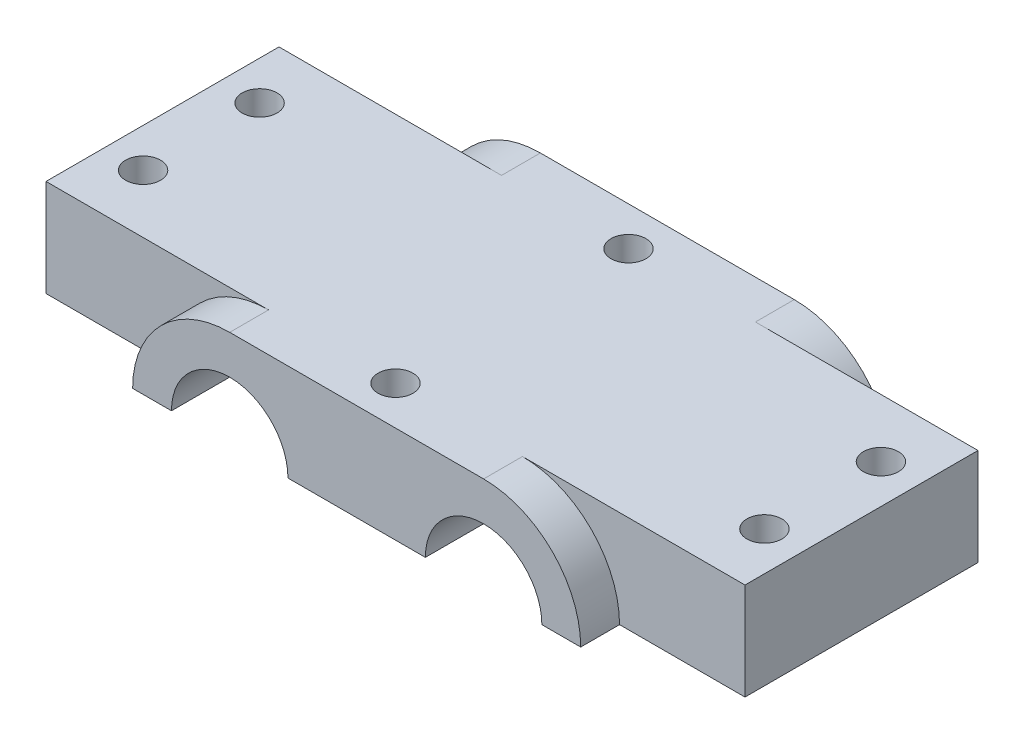
ISO-10303-21;
HEADER;
FILE_DESCRIPTION(('STEP AP214'),'2;1');
FILE_NAME('part.step','',(''),(''),'','','');
FILE_SCHEMA(('AUTOMOTIVE_DESIGN { 1 0 10303 214 1 1 1 1 }'));
ENDSEC;
DATA;
#1=APPLICATION_CONTEXT('core data for automotive mechanical design processes');
#2=APPLICATION_PROTOCOL_DEFINITION('international standard','automotive_design',2000,#1);
#3=PRODUCT_CONTEXT('',#1,'mechanical');
#4=PRODUCT('Part','Part','',(#3));
#5=PRODUCT_RELATED_PRODUCT_CATEGORY('part','',(#4));
#6=PRODUCT_DEFINITION_FORMATION('','',#4);
#7=PRODUCT_DEFINITION_CONTEXT('part definition',#1,'design');
#8=PRODUCT_DEFINITION('design','',#6,#7);
#9=PRODUCT_DEFINITION_SHAPE('','',#8);
#10=(LENGTH_UNIT() NAMED_UNIT(*) SI_UNIT(.MILLI.,.METRE.));
#11=(NAMED_UNIT(*) PLANE_ANGLE_UNIT() SI_UNIT($,.RADIAN.));
#12=(NAMED_UNIT(*) SI_UNIT($,.STERADIAN.) SOLID_ANGLE_UNIT());
#13=UNCERTAINTY_MEASURE_WITH_UNIT(LENGTH_MEASURE(1.E-05),#10,'distance_accuracy_value','');
#14=(GEOMETRIC_REPRESENTATION_CONTEXT(3) GLOBAL_UNCERTAINTY_ASSIGNED_CONTEXT((#13)) GLOBAL_UNIT_ASSIGNED_CONTEXT((#10,
#11,#12)) REPRESENTATION_CONTEXT('',''));
#15=CARTESIAN_POINT('',(0.,0.,0.));
#16=DIRECTION('',(0.,0.,1.));
#17=DIRECTION('',(1.,0.,0.));
#18=AXIS2_PLACEMENT_3D('',#15,#16,#17);
#19=CARTESIAN_POINT('',(0.,-6.25,0.));
#20=DIRECTION('',(0.,1.,0.));
#21=DIRECTION('',(0.,0.,1.));
#22=AXIS2_PLACEMENT_3D('',#19,#20,#21);
#23=PLANE('',#22);
#24=CARTESIAN_POINT('',(0.,-6.25,15.));
#25=DIRECTION('',(0.,1.,0.));
#26=DIRECTION('',(0.,0.,-1.));
#27=AXIS2_PLACEMENT_3D('',#24,#25,#26);
#28=CIRCLE('',#27,2.25);
#29=CARTESIAN_POINT('',(0.,-6.25,12.75));
#30=VERTEX_POINT('',#29);
#31=EDGE_CURVE('E351',#30,#30,#28,.T.);
#32=ORIENTED_EDGE('',*,*,#31,.T.);
#33=EDGE_LOOP('',(#32));
#34=FACE_BOUND('',#33,.T.);
#35=CARTESIAN_POINT('',(0.,-6.25,-15.));
#36=DIRECTION('',(0.,1.,0.));
#37=DIRECTION('',(0.,0.,1.));
#38=AXIS2_PLACEMENT_3D('',#35,#36,#37);
#39=CIRCLE('',#38,2.25);
#40=CARTESIAN_POINT('',(0.,-6.25,-12.75));
#41=VERTEX_POINT('',#40);
#42=EDGE_CURVE('E356',#41,#41,#39,.T.);
#43=ORIENTED_EDGE('',*,*,#42,.T.);
#44=EDGE_LOOP('',(#43));
#45=FACE_BOUND('',#44,.T.);
#46=DIRECTION('',(1.,0.,0.));
#47=VECTOR('',#46,1.);
#48=CARTESIAN_POINT('',(-8.84587103827753,-6.25,-20.));
#49=LINE('',#48,#47);
#50=CARTESIAN_POINT('',(-8.84587103827753,-6.25,-20.));
#51=VERTEX_POINT('',#50);
#52=CARTESIAN_POINT('',(8.84587103827753,-6.25,-20.));
#53=VERTEX_POINT('',#52);
#54=EDGE_CURVE('E183',#51,#53,#49,.T.);
#55=ORIENTED_EDGE('',*,*,#54,.T.);
#56=DIRECTION('',(0.,0.,-1.));
#57=VECTOR('',#56,1.);
#58=CARTESIAN_POINT('',(8.84587103827753,-6.25,20.));
#59=LINE('',#58,#57);
#60=CARTESIAN_POINT('',(8.84587103827753,-6.25,20.));
#61=VERTEX_POINT('',#60);
#62=EDGE_CURVE('E230',#61,#53,#59,.T.);
#63=ORIENTED_EDGE('',*,*,#62,.F.);
#64=DIRECTION('',(1.,0.,0.));
#65=VECTOR('',#64,1.);
#66=CARTESIAN_POINT('',(-8.84587103827753,-6.25,20.));
#67=LINE('',#66,#65);
#68=CARTESIAN_POINT('',(-8.84587103827753,-6.25,20.));
#69=VERTEX_POINT('',#68);
#70=EDGE_CURVE('E206',#69,#61,#67,.T.);
#71=ORIENTED_EDGE('',*,*,#70,.F.);
#72=DIRECTION('',(0.,0.,-1.));
#73=VECTOR('',#72,1.);
#74=CARTESIAN_POINT('',(-8.84587103827753,-6.25,20.));
#75=LINE('',#74,#73);
#76=EDGE_CURVE('E232',#69,#51,#75,.T.);
#77=ORIENTED_EDGE('',*,*,#76,.T.);
#78=EDGE_LOOP('',(#55,#63,#71,#77));
#79=FACE_BOUND('',#78,.T.);
#80=ADVANCED_FACE('F33',(#34,#45,#79),#23,.F.);
#81=CARTESIAN_POINT('',(-40.,-6.25,7.5));
#82=DIRECTION('',(0.,1.,0.));
#83=DIRECTION('',(0.,0.,1.));
#84=AXIS2_PLACEMENT_3D('',#81,#82,#83);
#85=CIRCLE('',#84,2.25);
#86=CARTESIAN_POINT('',(-40.,-6.25,9.75000000000001));
#87=VERTEX_POINT('',#86);
#88=EDGE_CURVE('E334',#87,#87,#85,.T.);
#89=ORIENTED_EDGE('',*,*,#88,.T.);
#90=EDGE_LOOP('',(#89));
#91=FACE_BOUND('',#90,.T.);
#92=CARTESIAN_POINT('',(-40.,-6.25,-7.5));
#93=DIRECTION('',(0.,1.,0.));
#94=DIRECTION('',(0.,0.,1.));
#95=AXIS2_PLACEMENT_3D('',#92,#93,#94);
#96=CIRCLE('',#95,2.25);
#97=CARTESIAN_POINT('',(-40.,-6.25,-5.24999999999999));
#98=VERTEX_POINT('',#97);
#99=EDGE_CURVE('E192',#98,#98,#96,.T.);
#100=ORIENTED_EDGE('',*,*,#99,.T.);
#101=EDGE_LOOP('',(#100));
#102=FACE_BOUND('',#101,.T.);
#103=DIRECTION('',(1.,0.,0.));
#104=VECTOR('',#103,1.);
#105=CARTESIAN_POINT('',(-28.8458710382775,-6.25,-20.));
#106=LINE('',#105,#104);
#107=CARTESIAN_POINT('',(-28.8458710382775,-6.25,-20.));
#108=VERTEX_POINT('',#107);
#109=CARTESIAN_POINT('',(-23.8458710382775,-6.25,-20.));
#110=VERTEX_POINT('',#109);
#111=EDGE_CURVE('E166',#108,#110,#106,.T.);
#112=ORIENTED_EDGE('',*,*,#111,.T.);
#113=DIRECTION('',(0.,0.,-1.));
#114=VECTOR('',#113,1.);
#115=CARTESIAN_POINT('',(-23.8458710382775,-6.25,20.));
#116=LINE('',#115,#114);
#117=CARTESIAN_POINT('',(-23.8458710382775,-6.25,20.));
#118=VERTEX_POINT('',#117);
#119=EDGE_CURVE('E234',#118,#110,#116,.T.);
#120=ORIENTED_EDGE('',*,*,#119,.F.);
#121=DIRECTION('',(1.,0.,0.));
#122=VECTOR('',#121,1.);
#123=CARTESIAN_POINT('',(-28.8458710382775,-6.25,20.));
#124=LINE('',#123,#122);
#125=CARTESIAN_POINT('',(-28.8458710382775,-6.25,20.));
#126=VERTEX_POINT('',#125);
#127=EDGE_CURVE('E201',#126,#118,#124,.T.);
#128=ORIENTED_EDGE('',*,*,#127,.F.);
#129=DIRECTION('',(0.,0.,-1.));
#130=VECTOR('',#129,1.);
#131=CARTESIAN_POINT('',(-28.8458710382775,-6.25,20.));
#132=LINE('',#131,#130);
#133=CARTESIAN_POINT('',(-28.8458710382775,-6.25,15.));
#134=VERTEX_POINT('',#133);
#135=EDGE_CURVE('E236',#126,#134,#132,.T.);
#136=ORIENTED_EDGE('',*,*,#135,.T.);
#137=DIRECTION('',(1.,0.,0.));
#138=VECTOR('',#137,1.);
#139=CARTESIAN_POINT('',(45.,-6.25,15.));
#140=LINE('',#139,#138);
#141=CARTESIAN_POINT('',(-45.,-6.25,15.));
#142=VERTEX_POINT('',#141);
#143=EDGE_CURVE('E255',#142,#134,#140,.T.);
#144=ORIENTED_EDGE('',*,*,#143,.F.);
#145=DIRECTION('',(0.,0.,1.));
#146=VECTOR('',#145,1.);
#147=CARTESIAN_POINT('',(-45.,-6.25,15.));
#148=LINE('',#147,#146);
#149=CARTESIAN_POINT('',(-45.,-6.25,-15.));
#150=VERTEX_POINT('',#149);
#151=EDGE_CURVE('E239',#150,#142,#148,.T.);
#152=ORIENTED_EDGE('',*,*,#151,.F.);
#153=DIRECTION('',(-1.,0.,0.));
#154=VECTOR('',#153,1.);
#155=CARTESIAN_POINT('',(45.,-6.25,-15.));
#156=LINE('',#155,#154);
#157=CARTESIAN_POINT('',(-28.8458710382775,-6.25,-15.));
#158=VERTEX_POINT('',#157);
#159=EDGE_CURVE('E259',#158,#150,#156,.T.);
#160=ORIENTED_EDGE('',*,*,#159,.F.);
#161=DIRECTION('',(0.,0.,1.));
#162=VECTOR('',#161,1.);
#163=CARTESIAN_POINT('',(-28.8458710382775,-6.25,-20.));
#164=LINE('',#163,#162);
#165=EDGE_CURVE('E190',#108,#158,#164,.T.);
#166=ORIENTED_EDGE('',*,*,#165,.F.);
#167=EDGE_LOOP('',(#112,#120,#128,#136,#144,#152,#160,#166));
#168=FACE_BOUND('',#167,.T.);
#169=ADVANCED_FACE('F298',(#91,#102,#168),#23,.F.);
#170=CARTESIAN_POINT('',(45.,6.25,-15.));
#171=DIRECTION('',(0.,0.,1.));
#172=DIRECTION('',(1.,0.,0.));
#173=AXIS2_PLACEMENT_3D('',#170,#171,#172);
#174=PLANE('',#173);
#175=DIRECTION('',(-1.,0.,0.));
#176=VECTOR('',#175,1.);
#177=CARTESIAN_POINT('',(45.,6.25,-15.));
#178=LINE('',#177,#176);
#179=CARTESIAN_POINT('',(-16.3458710382775,6.25,-15.));
#180=VERTEX_POINT('',#179);
#181=CARTESIAN_POINT('',(-45.,6.25,-15.));
#182=VERTEX_POINT('',#181);
#183=EDGE_CURVE('E248',#180,#182,#178,.T.);
#184=ORIENTED_EDGE('',*,*,#183,.F.);
#185=CARTESIAN_POINT('',(-16.3458710382775,-6.25,-15.));
#186=DIRECTION('',(0.,0.,1.));
#187=DIRECTION('',(1.,0.,0.));
#188=AXIS2_PLACEMENT_3D('',#185,#186,#187);
#189=CIRCLE('',#188,12.5);
#190=EDGE_CURVE('E153',#180,#158,#189,.T.);
#191=ORIENTED_EDGE('',*,*,#190,.T.);
#192=ORIENTED_EDGE('',*,*,#159,.T.);
#193=DIRECTION('',(0.,-1.,0.));
#194=VECTOR('',#193,1.);
#195=CARTESIAN_POINT('',(-45.,6.25,-15.));
#196=LINE('',#195,#194);
#197=EDGE_CURVE('E251',#182,#150,#196,.T.);
#198=ORIENTED_EDGE('',*,*,#197,.F.);
#199=EDGE_LOOP('',(#184,#191,#192,#198));
#200=FACE_BOUND('',#199,.T.);
#201=ADVANCED_FACE('F294',(#200),#174,.F.);
#202=CARTESIAN_POINT('',(45.,6.25,15.));
#203=DIRECTION('',(0.,0.,-1.));
#204=DIRECTION('',(-1.,0.,0.));
#205=AXIS2_PLACEMENT_3D('',#202,#203,#204);
#206=PLANE('',#205);
#207=CARTESIAN_POINT('',(-16.3458710382775,-6.25,15.));
#208=DIRECTION('',(0.,0.,1.));
#209=DIRECTION('',(1.,0.,0.));
#210=AXIS2_PLACEMENT_3D('',#207,#208,#209);
#211=CIRCLE('',#210,12.5);
#212=CARTESIAN_POINT('',(-16.3458710382775,6.25,15.));
#213=VERTEX_POINT('',#212);
#214=EDGE_CURVE('E157',#213,#134,#211,.T.);
#215=ORIENTED_EDGE('',*,*,#214,.F.);
#216=DIRECTION('',(1.,0.,0.));
#217=VECTOR('',#216,1.);
#218=CARTESIAN_POINT('',(45.,6.25,15.));
#219=LINE('',#218,#217);
#220=CARTESIAN_POINT('',(-45.,6.25,15.));
#221=VERTEX_POINT('',#220);
#222=EDGE_CURVE('E243',#221,#213,#219,.T.);
#223=ORIENTED_EDGE('',*,*,#222,.F.);
#224=DIRECTION('',(0.,-1.,0.));
#225=VECTOR('',#224,1.);
#226=CARTESIAN_POINT('',(-45.,6.25,15.));
#227=LINE('',#226,#225);
#228=EDGE_CURVE('E11',#221,#142,#227,.T.);
#229=ORIENTED_EDGE('',*,*,#228,.T.);
#230=ORIENTED_EDGE('',*,*,#143,.T.);
#231=EDGE_LOOP('',(#215,#223,#229,#230));
#232=FACE_BOUND('',#231,.T.);
#233=ADVANCED_FACE('F288',(#232),#206,.F.);
#234=CARTESIAN_POINT('',(16.3458710382775,-6.25,15.));
#235=DIRECTION('',(0.,0.,1.));
#236=DIRECTION('',(-1.,0.,0.));
#237=AXIS2_PLACEMENT_3D('',#234,#235,#236);
#238=CIRCLE('',#237,12.5);
#239=CARTESIAN_POINT('',(28.8458710382775,-6.25,15.));
#240=VERTEX_POINT('',#239);
#241=CARTESIAN_POINT('',(16.3458710382775,6.25,15.));
#242=VERTEX_POINT('',#241);
#243=EDGE_CURVE('E202',#240,#242,#238,.T.);
#244=ORIENTED_EDGE('',*,*,#243,.F.);
#245=CARTESIAN_POINT('',(45.,-6.25,15.));
#246=VERTEX_POINT('',#245);
#247=EDGE_CURVE('E254',#240,#246,#140,.T.);
#248=ORIENTED_EDGE('',*,*,#247,.T.);
#249=DIRECTION('',(0.,-1.,0.));
#250=VECTOR('',#249,1.);
#251=CARTESIAN_POINT('',(45.,6.25,15.));
#252=LINE('',#251,#250);
#253=CARTESIAN_POINT('',(45.,6.25,15.));
#254=VERTEX_POINT('',#253);
#255=EDGE_CURVE('E41',#254,#246,#252,.T.);
#256=ORIENTED_EDGE('',*,*,#255,.F.);
#257=EDGE_CURVE('E56',#242,#254,#219,.T.);
#258=ORIENTED_EDGE('',*,*,#257,.F.);
#259=EDGE_LOOP('',(#244,#248,#256,#258));
#260=FACE_BOUND('',#259,.T.);
#261=ADVANCED_FACE('F286',(#260),#206,.F.);
#262=CARTESIAN_POINT('',(-45.,6.25,15.));
#263=DIRECTION('',(1.,0.,0.));
#264=DIRECTION('',(0.,0.,-1.));
#265=AXIS2_PLACEMENT_3D('',#262,#263,#264);
#266=PLANE('',#265);
#267=ORIENTED_EDGE('',*,*,#151,.T.);
#268=ORIENTED_EDGE('',*,*,#228,.F.);
#269=DIRECTION('',(0.,0.,1.));
#270=VECTOR('',#269,1.);
#271=CARTESIAN_POINT('',(-45.,6.25,15.));
#272=LINE('',#271,#270);
#273=EDGE_CURVE('E240',#182,#221,#272,.T.);
#274=ORIENTED_EDGE('',*,*,#273,.F.);
#275=ORIENTED_EDGE('',*,*,#197,.T.);
#276=EDGE_LOOP('',(#267,#268,#274,#275));
#277=FACE_BOUND('',#276,.T.);
#278=ADVANCED_FACE('F35',(#277),#266,.F.);
#279=CARTESIAN_POINT('',(45.,6.25,15.));
#280=DIRECTION('',(-1.,0.,0.));
#281=DIRECTION('',(0.,0.,1.));
#282=AXIS2_PLACEMENT_3D('',#279,#280,#281);
#283=PLANE('',#282);
#284=DIRECTION('',(0.,0.,-1.));
#285=VECTOR('',#284,1.);
#286=CARTESIAN_POINT('',(45.,-6.25,15.));
#287=LINE('',#286,#285);
#288=CARTESIAN_POINT('',(45.,-6.25,-15.));
#289=VERTEX_POINT('',#288);
#290=EDGE_CURVE('E257',#246,#289,#287,.T.);
#291=ORIENTED_EDGE('',*,*,#290,.T.);
#292=DIRECTION('',(0.,-1.,0.));
#293=VECTOR('',#292,1.);
#294=CARTESIAN_POINT('',(45.,6.25,-15.));
#295=LINE('',#294,#293);
#296=CARTESIAN_POINT('',(45.,6.25,-15.));
#297=VERTEX_POINT('',#296);
#298=EDGE_CURVE('E264',#297,#289,#295,.T.);
#299=ORIENTED_EDGE('',*,*,#298,.F.);
#300=DIRECTION('',(0.,0.,-1.));
#301=VECTOR('',#300,1.);
#302=CARTESIAN_POINT('',(45.,6.25,15.));
#303=LINE('',#302,#301);
#304=EDGE_CURVE('E246',#254,#297,#303,.T.);
#305=ORIENTED_EDGE('',*,*,#304,.F.);
#306=ORIENTED_EDGE('',*,*,#255,.T.);
#307=EDGE_LOOP('',(#291,#299,#305,#306));
#308=FACE_BOUND('',#307,.T.);
#309=ADVANCED_FACE('F270',(#308),#283,.F.);
#310=CARTESIAN_POINT('',(28.8458710382775,-6.25,-15.));
#311=VERTEX_POINT('',#310);
#312=EDGE_CURVE('E242',#289,#311,#156,.T.);
#313=ORIENTED_EDGE('',*,*,#312,.T.);
#314=CARTESIAN_POINT('',(16.3458710382775,-6.25,-15.));
#315=DIRECTION('',(0.,0.,1.));
#316=DIRECTION('',(-1.,0.,0.));
#317=AXIS2_PLACEMENT_3D('',#314,#315,#316);
#318=CIRCLE('',#317,12.5);
#319=CARTESIAN_POINT('',(16.3458710382775,6.25,-15.));
#320=VERTEX_POINT('',#319);
#321=EDGE_CURVE('E167',#311,#320,#318,.T.);
#322=ORIENTED_EDGE('',*,*,#321,.T.);
#323=EDGE_CURVE('E249',#297,#320,#178,.T.);
#324=ORIENTED_EDGE('',*,*,#323,.F.);
#325=ORIENTED_EDGE('',*,*,#298,.T.);
#326=EDGE_LOOP('',(#313,#322,#324,#325));
#327=FACE_BOUND('',#326,.T.);
#328=ADVANCED_FACE('F278',(#327),#174,.F.);
#329=CARTESIAN_POINT('',(0.,6.25,0.));
#330=DIRECTION('',(0.,1.,0.));
#331=DIRECTION('',(0.,0.,1.));
#332=AXIS2_PLACEMENT_3D('',#329,#330,#331);
#333=PLANE('',#332);
#334=CARTESIAN_POINT('',(0.,6.25,15.));
#335=DIRECTION('',(0.,1.,0.));
#336=DIRECTION('',(0.,0.,-1.));
#337=AXIS2_PLACEMENT_3D('',#334,#335,#336);
#338=CIRCLE('',#337,2.25);
#339=CARTESIAN_POINT('',(0.,6.25,12.75));
#340=VERTEX_POINT('',#339);
#341=EDGE_CURVE('E348',#340,#340,#338,.T.);
#342=ORIENTED_EDGE('',*,*,#341,.F.);
#343=EDGE_LOOP('',(#342));
#344=FACE_BOUND('',#343,.T.);
#345=CARTESIAN_POINT('',(0.,6.25,-15.));
#346=DIRECTION('',(0.,1.,0.));
#347=DIRECTION('',(0.,0.,1.));
#348=AXIS2_PLACEMENT_3D('',#345,#346,#347);
#349=CIRCLE('',#348,2.25);
#350=CARTESIAN_POINT('',(0.,6.25,-12.75));
#351=VERTEX_POINT('',#350);
#352=EDGE_CURVE('E353',#351,#351,#349,.T.);
#353=ORIENTED_EDGE('',*,*,#352,.F.);
#354=EDGE_LOOP('',(#353));
#355=FACE_BOUND('',#354,.T.);
#356=CARTESIAN_POINT('',(40.,6.25,-7.5));
#357=DIRECTION('',(0.,1.,0.));
#358=DIRECTION('',(0.,0.,-1.));
#359=AXIS2_PLACEMENT_3D('',#356,#357,#358);
#360=CIRCLE('',#359,2.25);
#361=CARTESIAN_POINT('',(40.,6.25,-9.75));
#362=VERTEX_POINT('',#361);
#363=EDGE_CURVE('E359',#362,#362,#360,.T.);
#364=ORIENTED_EDGE('',*,*,#363,.F.);
#365=EDGE_LOOP('',(#364));
#366=FACE_BOUND('',#365,.T.);
#367=CARTESIAN_POINT('',(40.,6.25,7.5));
#368=DIRECTION('',(0.,1.,0.));
#369=DIRECTION('',(0.,0.,-1.));
#370=AXIS2_PLACEMENT_3D('',#367,#368,#369);
#371=CIRCLE('',#370,2.25);
#372=CARTESIAN_POINT('',(40.,6.25,5.25));
#373=VERTEX_POINT('',#372);
#374=EDGE_CURVE('E331',#373,#373,#371,.T.);
#375=ORIENTED_EDGE('',*,*,#374,.F.);
#376=EDGE_LOOP('',(#375));
#377=FACE_BOUND('',#376,.T.);
#378=CARTESIAN_POINT('',(-40.,6.25,7.5));
#379=DIRECTION('',(0.,1.,0.));
#380=DIRECTION('',(0.,0.,1.));
#381=AXIS2_PLACEMENT_3D('',#378,#379,#380);
#382=CIRCLE('',#381,2.25);
#383=CARTESIAN_POINT('',(-40.,6.25,9.75000000000001));
#384=VERTEX_POINT('',#383);
#385=EDGE_CURVE('E330',#384,#384,#382,.T.);
#386=ORIENTED_EDGE('',*,*,#385,.F.);
#387=EDGE_LOOP('',(#386));
#388=FACE_BOUND('',#387,.T.);
#389=CARTESIAN_POINT('',(-40.,6.25,-7.5));
#390=DIRECTION('',(0.,1.,0.));
#391=DIRECTION('',(0.,0.,1.));
#392=AXIS2_PLACEMENT_3D('',#389,#390,#391);
#393=CIRCLE('',#392,2.25);
#394=CARTESIAN_POINT('',(-40.,6.25,-5.24999999999999));
#395=VERTEX_POINT('',#394);
#396=EDGE_CURVE('E341',#395,#395,#393,.T.);
#397=ORIENTED_EDGE('',*,*,#396,.F.);
#398=EDGE_LOOP('',(#397));
#399=FACE_BOUND('',#398,.T.);
#400=ORIENTED_EDGE('',*,*,#273,.T.);
#401=ORIENTED_EDGE('',*,*,#222,.T.);
#402=DIRECTION('',(0.,0.,-1.));
#403=VECTOR('',#402,1.);
#404=CARTESIAN_POINT('',(-16.3458710382775,6.25,20.));
#405=LINE('',#404,#403);
#406=CARTESIAN_POINT('',(-16.3458710382775,6.25,20.));
#407=VERTEX_POINT('',#406);
#408=EDGE_CURVE('E216',#407,#213,#405,.T.);
#409=ORIENTED_EDGE('',*,*,#408,.F.);
#410=DIRECTION('',(-1.,0.,0.));
#411=VECTOR('',#410,1.);
#412=CARTESIAN_POINT('',(-16.3458710382775,6.25,20.));
#413=LINE('',#412,#411);
#414=CARTESIAN_POINT('',(16.3458710382775,6.25,20.));
#415=VERTEX_POINT('',#414);
#416=EDGE_CURVE('E214',#415,#407,#413,.T.);
#417=ORIENTED_EDGE('',*,*,#416,.F.);
#418=DIRECTION('',(0.,0.,-1.));
#419=VECTOR('',#418,1.);
#420=CARTESIAN_POINT('',(16.3458710382775,6.25,20.));
#421=LINE('',#420,#419);
#422=EDGE_CURVE('E222',#415,#242,#421,.T.);
#423=ORIENTED_EDGE('',*,*,#422,.T.);
#424=ORIENTED_EDGE('',*,*,#257,.T.);
#425=ORIENTED_EDGE('',*,*,#304,.T.);
#426=ORIENTED_EDGE('',*,*,#323,.T.);
#427=DIRECTION('',(0.,0.,1.));
#428=VECTOR('',#427,1.);
#429=CARTESIAN_POINT('',(16.3458710382775,6.25,-20.));
#430=LINE('',#429,#428);
#431=CARTESIAN_POINT('',(16.3458710382775,6.25,-20.));
#432=VERTEX_POINT('',#431);
#433=EDGE_CURVE('E48',#432,#320,#430,.T.);
#434=ORIENTED_EDGE('',*,*,#433,.F.);
#435=DIRECTION('',(-1.,0.,0.));
#436=VECTOR('',#435,1.);
#437=CARTESIAN_POINT('',(-16.3458710382775,6.25,-20.));
#438=LINE('',#437,#436);
#439=CARTESIAN_POINT('',(-16.3458710382775,6.25,-20.));
#440=VERTEX_POINT('',#439);
#441=EDGE_CURVE('E163',#432,#440,#438,.T.);
#442=ORIENTED_EDGE('',*,*,#441,.T.);
#443=DIRECTION('',(0.,0.,1.));
#444=VECTOR('',#443,1.);
#445=CARTESIAN_POINT('',(-16.3458710382775,6.25,-20.));
#446=LINE('',#445,#444);
#447=EDGE_CURVE('E147',#440,#180,#446,.T.);
#448=ORIENTED_EDGE('',*,*,#447,.T.);
#449=ORIENTED_EDGE('',*,*,#183,.T.);
#450=EDGE_LOOP('',(#400,#401,#409,#417,#423,#424,#425,#426,#434,#442,#448,#449));
#451=FACE_BOUND('',#450,.T.);
#452=ADVANCED_FACE('F170',(#344,#355,#366,#377,#388,#399,#451),#333,.T.);
#453=CARTESIAN_POINT('',(40.,-6.25,-7.5));
#454=DIRECTION('',(0.,1.,0.));
#455=DIRECTION('',(0.,0.,-1.));
#456=AXIS2_PLACEMENT_3D('',#453,#454,#455);
#457=CIRCLE('',#456,2.25);
#458=CARTESIAN_POINT('',(40.,-6.25,-9.75));
#459=VERTEX_POINT('',#458);
#460=EDGE_CURVE('E325',#459,#459,#457,.T.);
#461=ORIENTED_EDGE('',*,*,#460,.T.);
#462=EDGE_LOOP('',(#461));
#463=FACE_BOUND('',#462,.T.);
#464=CARTESIAN_POINT('',(40.,-6.25,7.5));
#465=DIRECTION('',(0.,1.,0.));
#466=DIRECTION('',(0.,0.,-1.));
#467=AXIS2_PLACEMENT_3D('',#464,#465,#466);
#468=CIRCLE('',#467,2.25);
#469=CARTESIAN_POINT('',(40.,-6.25,5.25));
#470=VERTEX_POINT('',#469);
#471=EDGE_CURVE('E328',#470,#470,#468,.T.);
#472=ORIENTED_EDGE('',*,*,#471,.T.);
#473=EDGE_LOOP('',(#472));
#474=FACE_BOUND('',#473,.T.);
#475=DIRECTION('',(0.,0.,-1.));
#476=VECTOR('',#475,1.);
#477=CARTESIAN_POINT('',(23.8458710382775,-6.25,20.));
#478=LINE('',#477,#476);
#479=CARTESIAN_POINT('',(23.8458710382775,-6.25,20.));
#480=VERTEX_POINT('',#479);
#481=CARTESIAN_POINT('',(23.8458710382775,-6.25,-20.));
#482=VERTEX_POINT('',#481);
#483=EDGE_CURVE('E228',#480,#482,#478,.T.);
#484=ORIENTED_EDGE('',*,*,#483,.T.);
#485=DIRECTION('',(1.,0.,0.));
#486=VECTOR('',#485,1.);
#487=CARTESIAN_POINT('',(23.8458710382775,-6.25,-20.));
#488=LINE('',#487,#486);
#489=CARTESIAN_POINT('',(28.8458710382775,-6.25,-20.));
#490=VERTEX_POINT('',#489);
#491=EDGE_CURVE('E174',#482,#490,#488,.T.);
#492=ORIENTED_EDGE('',*,*,#491,.T.);
#493=DIRECTION('',(0.,0.,1.));
#494=VECTOR('',#493,1.);
#495=CARTESIAN_POINT('',(28.8458710382775,-6.25,-20.));
#496=LINE('',#495,#494);
#497=EDGE_CURVE('E195',#490,#311,#496,.T.);
#498=ORIENTED_EDGE('',*,*,#497,.T.);
#499=ORIENTED_EDGE('',*,*,#312,.F.);
#500=ORIENTED_EDGE('',*,*,#290,.F.);
#501=ORIENTED_EDGE('',*,*,#247,.F.);
#502=DIRECTION('',(0.,0.,-1.));
#503=VECTOR('',#502,1.);
#504=CARTESIAN_POINT('',(28.8458710382775,-6.25,20.));
#505=LINE('',#504,#503);
#506=CARTESIAN_POINT('',(28.8458710382775,-6.25,20.));
#507=VERTEX_POINT('',#506);
#508=EDGE_CURVE('E225',#507,#240,#505,.T.);
#509=ORIENTED_EDGE('',*,*,#508,.F.);
#510=DIRECTION('',(1.,0.,0.));
#511=VECTOR('',#510,1.);
#512=CARTESIAN_POINT('',(23.8458710382775,-6.25,20.));
#513=LINE('',#512,#511);
#514=EDGE_CURVE('E210',#480,#507,#513,.T.);
#515=ORIENTED_EDGE('',*,*,#514,.F.);
#516=EDGE_LOOP('',(#484,#492,#498,#499,#500,#501,#509,#515));
#517=FACE_BOUND('',#516,.T.);
#518=ADVANCED_FACE('F275',(#463,#474,#517),#23,.F.);
#519=CARTESIAN_POINT('',(-16.3458710382775,-6.25,20.));
#520=DIRECTION('',(0.,0.,-1.));
#521=DIRECTION('',(-1.,0.,0.));
#522=AXIS2_PLACEMENT_3D('',#519,#520,#521);
#523=CYLINDRICAL_SURFACE('',#522,12.5);
#524=ORIENTED_EDGE('',*,*,#214,.T.);
#525=ORIENTED_EDGE('',*,*,#135,.F.);
#526=CARTESIAN_POINT('',(-16.3458710382775,-6.25,20.));
#527=DIRECTION('',(0.,0.,1.));
#528=DIRECTION('',(1.,0.,0.));
#529=AXIS2_PLACEMENT_3D('',#526,#527,#528);
#530=CIRCLE('',#529,12.5);
#531=EDGE_CURVE('E198',#407,#126,#530,.T.);
#532=ORIENTED_EDGE('',*,*,#531,.F.);
#533=ORIENTED_EDGE('',*,*,#408,.T.);
#534=EDGE_LOOP('',(#524,#525,#532,#533));
#535=FACE_BOUND('',#534,.T.);
#536=ADVANCED_FACE('F311',(#535),#523,.T.);
#537=CARTESIAN_POINT('',(-16.3458710382775,-6.25,20.));
#538=DIRECTION('',(0.,0.,-1.));
#539=DIRECTION('',(-1.,0.,0.));
#540=AXIS2_PLACEMENT_3D('',#537,#538,#539);
#541=CYLINDRICAL_SURFACE('',#540,7.5);
#542=ORIENTED_EDGE('',*,*,#119,.T.);
#543=CARTESIAN_POINT('',(-16.3458710382775,-6.25,-20.));
#544=DIRECTION('',(0.,0.,-1.));
#545=DIRECTION('',(1.,0.,0.));
#546=AXIS2_PLACEMENT_3D('',#543,#544,#545);
#547=CIRCLE('',#546,7.5);
#548=EDGE_CURVE('E186',#110,#51,#547,.T.);
#549=ORIENTED_EDGE('',*,*,#548,.T.);
#550=ORIENTED_EDGE('',*,*,#76,.F.);
#551=CARTESIAN_POINT('',(-16.3458710382775,-6.25,20.));
#552=DIRECTION('',(0.,0.,-1.));
#553=DIRECTION('',(1.,0.,0.));
#554=AXIS2_PLACEMENT_3D('',#551,#552,#553);
#555=CIRCLE('',#554,7.5);
#556=EDGE_CURVE('E204',#118,#69,#555,.T.);
#557=ORIENTED_EDGE('',*,*,#556,.F.);
#558=EDGE_LOOP('',(#542,#549,#550,#557));
#559=FACE_BOUND('',#558,.T.);
#560=ADVANCED_FACE('F318',(#559),#541,.F.);
#561=CARTESIAN_POINT('',(16.3458710382775,-6.25,20.));
#562=DIRECTION('',(0.,0.,-1.));
#563=DIRECTION('',(-1.,0.,0.));
#564=AXIS2_PLACEMENT_3D('',#561,#562,#563);
#565=CYLINDRICAL_SURFACE('',#564,7.5);
#566=ORIENTED_EDGE('',*,*,#62,.T.);
#567=CARTESIAN_POINT('',(16.3458710382775,-6.25,-20.));
#568=DIRECTION('',(0.,0.,-1.));
#569=DIRECTION('',(-1.,0.,0.));
#570=AXIS2_PLACEMENT_3D('',#567,#568,#569);
#571=CIRCLE('',#570,7.5);
#572=EDGE_CURVE('E180',#53,#482,#571,.T.);
#573=ORIENTED_EDGE('',*,*,#572,.T.);
#574=ORIENTED_EDGE('',*,*,#483,.F.);
#575=CARTESIAN_POINT('',(16.3458710382775,-6.25,20.));
#576=DIRECTION('',(0.,0.,-1.));
#577=DIRECTION('',(-1.,0.,0.));
#578=AXIS2_PLACEMENT_3D('',#575,#576,#577);
#579=CIRCLE('',#578,7.5);
#580=EDGE_CURVE('E208',#61,#480,#579,.T.);
#581=ORIENTED_EDGE('',*,*,#580,.F.);
#582=EDGE_LOOP('',(#566,#573,#574,#581));
#583=FACE_BOUND('',#582,.T.);
#584=ADVANCED_FACE('F408',(#583),#565,.F.);
#585=CARTESIAN_POINT('',(16.3458710382775,-6.25,20.));
#586=DIRECTION('',(0.,0.,-1.));
#587=DIRECTION('',(-1.,0.,0.));
#588=AXIS2_PLACEMENT_3D('',#585,#586,#587);
#589=CYLINDRICAL_SURFACE('',#588,12.5);
#590=ORIENTED_EDGE('',*,*,#243,.T.);
#591=ORIENTED_EDGE('',*,*,#422,.F.);
#592=CARTESIAN_POINT('',(16.3458710382775,-6.25,20.));
#593=DIRECTION('',(0.,0.,1.));
#594=DIRECTION('',(-1.,0.,0.));
#595=AXIS2_PLACEMENT_3D('',#592,#593,#594);
#596=CIRCLE('',#595,12.5);
#597=EDGE_CURVE('E212',#507,#415,#596,.T.);
#598=ORIENTED_EDGE('',*,*,#597,.F.);
#599=ORIENTED_EDGE('',*,*,#508,.T.);
#600=EDGE_LOOP('',(#590,#591,#598,#599));
#601=FACE_BOUND('',#600,.T.);
#602=ADVANCED_FACE('F285',(#601),#589,.T.);
#603=CARTESIAN_POINT('',(-16.3458710382775,-6.25,20.));
#604=DIRECTION('',(0.,0.,1.));
#605=DIRECTION('',(1.,0.,0.));
#606=AXIS2_PLACEMENT_3D('',#603,#604,#605);
#607=PLANE('',#606);
#608=ORIENTED_EDGE('',*,*,#531,.T.);
#609=ORIENTED_EDGE('',*,*,#127,.T.);
#610=ORIENTED_EDGE('',*,*,#556,.T.);
#611=ORIENTED_EDGE('',*,*,#70,.T.);
#612=ORIENTED_EDGE('',*,*,#580,.T.);
#613=ORIENTED_EDGE('',*,*,#514,.T.);
#614=ORIENTED_EDGE('',*,*,#597,.T.);
#615=ORIENTED_EDGE('',*,*,#416,.T.);
#616=EDGE_LOOP('',(#608,#609,#610,#611,#612,#613,#614,#615));
#617=FACE_BOUND('',#616,.T.);
#618=ADVANCED_FACE('F402',(#617),#607,.T.);
#619=CARTESIAN_POINT('',(-16.3458710382775,-6.25,-20.));
#620=DIRECTION('',(0.,0.,1.));
#621=DIRECTION('',(1.,0.,0.));
#622=AXIS2_PLACEMENT_3D('',#619,#620,#621);
#623=CYLINDRICAL_SURFACE('',#622,12.5);
#624=ORIENTED_EDGE('',*,*,#190,.F.);
#625=ORIENTED_EDGE('',*,*,#447,.F.);
#626=CARTESIAN_POINT('',(-16.3458710382775,-6.25,-20.));
#627=DIRECTION('',(0.,0.,1.));
#628=DIRECTION('',(1.,0.,0.));
#629=AXIS2_PLACEMENT_3D('',#626,#627,#628);
#630=CIRCLE('',#629,12.5);
#631=EDGE_CURVE('E150',#440,#108,#630,.T.);
#632=ORIENTED_EDGE('',*,*,#631,.T.);
#633=ORIENTED_EDGE('',*,*,#165,.T.);
#634=EDGE_LOOP('',(#624,#625,#632,#633));
#635=FACE_BOUND('',#634,.T.);
#636=ADVANCED_FACE('F149',(#635),#623,.T.);
#637=CARTESIAN_POINT('',(16.3458710382775,-6.25,-20.));
#638=DIRECTION('',(0.,0.,1.));
#639=DIRECTION('',(1.,0.,0.));
#640=AXIS2_PLACEMENT_3D('',#637,#638,#639);
#641=CYLINDRICAL_SURFACE('',#640,12.5);
#642=ORIENTED_EDGE('',*,*,#321,.F.);
#643=ORIENTED_EDGE('',*,*,#497,.F.);
#644=CARTESIAN_POINT('',(16.3458710382775,-6.25,-20.));
#645=DIRECTION('',(0.,0.,1.));
#646=DIRECTION('',(-1.,0.,0.));
#647=AXIS2_PLACEMENT_3D('',#644,#645,#646);
#648=CIRCLE('',#647,12.5);
#649=EDGE_CURVE('E172',#490,#432,#648,.T.);
#650=ORIENTED_EDGE('',*,*,#649,.T.);
#651=ORIENTED_EDGE('',*,*,#433,.T.);
#652=EDGE_LOOP('',(#642,#643,#650,#651));
#653=FACE_BOUND('',#652,.T.);
#654=ADVANCED_FACE('F397',(#653),#641,.T.);
#655=CARTESIAN_POINT('',(-16.3458710382775,-6.25,-20.));
#656=DIRECTION('',(0.,0.,-1.));
#657=DIRECTION('',(1.,0.,0.));
#658=AXIS2_PLACEMENT_3D('',#655,#656,#657);
#659=PLANE('',#658);
#660=ORIENTED_EDGE('',*,*,#631,.F.);
#661=ORIENTED_EDGE('',*,*,#441,.F.);
#662=ORIENTED_EDGE('',*,*,#649,.F.);
#663=ORIENTED_EDGE('',*,*,#491,.F.);
#664=ORIENTED_EDGE('',*,*,#572,.F.);
#665=ORIENTED_EDGE('',*,*,#54,.F.);
#666=ORIENTED_EDGE('',*,*,#548,.F.);
#667=ORIENTED_EDGE('',*,*,#111,.F.);
#668=EDGE_LOOP('',(#660,#661,#662,#663,#664,#665,#666,#667));
#669=FACE_BOUND('',#668,.T.);
#670=ADVANCED_FACE('F161',(#669),#659,.T.);
#671=CARTESIAN_POINT('',(-40.,-6.25,-7.5));
#672=DIRECTION('',(0.,1.,0.));
#673=DIRECTION('',(0.,0.,1.));
#674=AXIS2_PLACEMENT_3D('',#671,#672,#673);
#675=CYLINDRICAL_SURFACE('',#674,2.25);
#676=ORIENTED_EDGE('',*,*,#99,.F.);
#677=EDGE_LOOP('',(#676));
#678=FACE_BOUND('',#677,.T.);
#679=ORIENTED_EDGE('',*,*,#396,.T.);
#680=EDGE_LOOP('',(#679));
#681=FACE_BOUND('',#680,.T.);
#682=ADVANCED_FACE('F391',(#678,#681),#675,.F.);
#683=CARTESIAN_POINT('',(40.,-6.25,7.5));
#684=DIRECTION('',(0.,1.,0.));
#685=DIRECTION('',(0.,0.,1.));
#686=AXIS2_PLACEMENT_3D('',#683,#684,#685);
#687=CYLINDRICAL_SURFACE('',#686,2.25);
#688=ORIENTED_EDGE('',*,*,#471,.F.);
#689=EDGE_LOOP('',(#688));
#690=FACE_BOUND('',#689,.T.);
#691=ORIENTED_EDGE('',*,*,#374,.T.);
#692=EDGE_LOOP('',(#691));
#693=FACE_BOUND('',#692,.T.);
#694=ADVANCED_FACE('F384',(#690,#693),#687,.F.);
#695=CARTESIAN_POINT('',(40.,-6.25,-7.5));
#696=DIRECTION('',(0.,1.,0.));
#697=DIRECTION('',(0.,0.,1.));
#698=AXIS2_PLACEMENT_3D('',#695,#696,#697);
#699=CYLINDRICAL_SURFACE('',#698,2.25);
#700=ORIENTED_EDGE('',*,*,#460,.F.);
#701=EDGE_LOOP('',(#700));
#702=FACE_BOUND('',#701,.T.);
#703=ORIENTED_EDGE('',*,*,#363,.T.);
#704=EDGE_LOOP('',(#703));
#705=FACE_BOUND('',#704,.T.);
#706=ADVANCED_FACE('F364',(#702,#705),#699,.F.);
#707=CARTESIAN_POINT('',(-40.,-6.25,7.5));
#708=DIRECTION('',(0.,1.,0.));
#709=DIRECTION('',(0.,0.,1.));
#710=AXIS2_PLACEMENT_3D('',#707,#708,#709);
#711=CYLINDRICAL_SURFACE('',#710,2.25);
#712=ORIENTED_EDGE('',*,*,#88,.F.);
#713=EDGE_LOOP('',(#712));
#714=FACE_BOUND('',#713,.T.);
#715=ORIENTED_EDGE('',*,*,#385,.T.);
#716=EDGE_LOOP('',(#715));
#717=FACE_BOUND('',#716,.T.);
#718=ADVANCED_FACE('F372',(#714,#717),#711,.F.);
#719=CARTESIAN_POINT('',(0.,-6.25,-15.));
#720=DIRECTION('',(0.,1.,0.));
#721=DIRECTION('',(0.,0.,1.));
#722=AXIS2_PLACEMENT_3D('',#719,#720,#721);
#723=CYLINDRICAL_SURFACE('',#722,2.25);
#724=ORIENTED_EDGE('',*,*,#42,.F.);
#725=EDGE_LOOP('',(#724));
#726=FACE_BOUND('',#725,.T.);
#727=ORIENTED_EDGE('',*,*,#352,.T.);
#728=EDGE_LOOP('',(#727));
#729=FACE_BOUND('',#728,.T.);
#730=ADVANCED_FACE('F374',(#726,#729),#723,.F.);
#731=CARTESIAN_POINT('',(0.,-6.25,15.));
#732=DIRECTION('',(0.,1.,0.));
#733=DIRECTION('',(0.,0.,1.));
#734=AXIS2_PLACEMENT_3D('',#731,#732,#733);
#735=CYLINDRICAL_SURFACE('',#734,2.25);
#736=ORIENTED_EDGE('',*,*,#31,.F.);
#737=EDGE_LOOP('',(#736));
#738=FACE_BOUND('',#737,.T.);
#739=ORIENTED_EDGE('',*,*,#341,.T.);
#740=EDGE_LOOP('',(#739));
#741=FACE_BOUND('',#740,.T.);
#742=ADVANCED_FACE('F381',(#738,#741),#735,.F.);
#743=CLOSED_SHELL('',(#80,#169,#201,#233,#261,#278,#309,#328,#452,#518,#536,#560,#584,#602,#618,
#636,#654,#670,#682,#694,#706,#718,#730,#742));
#744=MANIFOLD_SOLID_BREP('B2',#743);
#745=ADVANCED_BREP_SHAPE_REPRESENTATION('',(#18,#744),#14);
#746=SHAPE_DEFINITION_REPRESENTATION(#9,#745);
ENDSEC;
END-ISO-10303-21;
